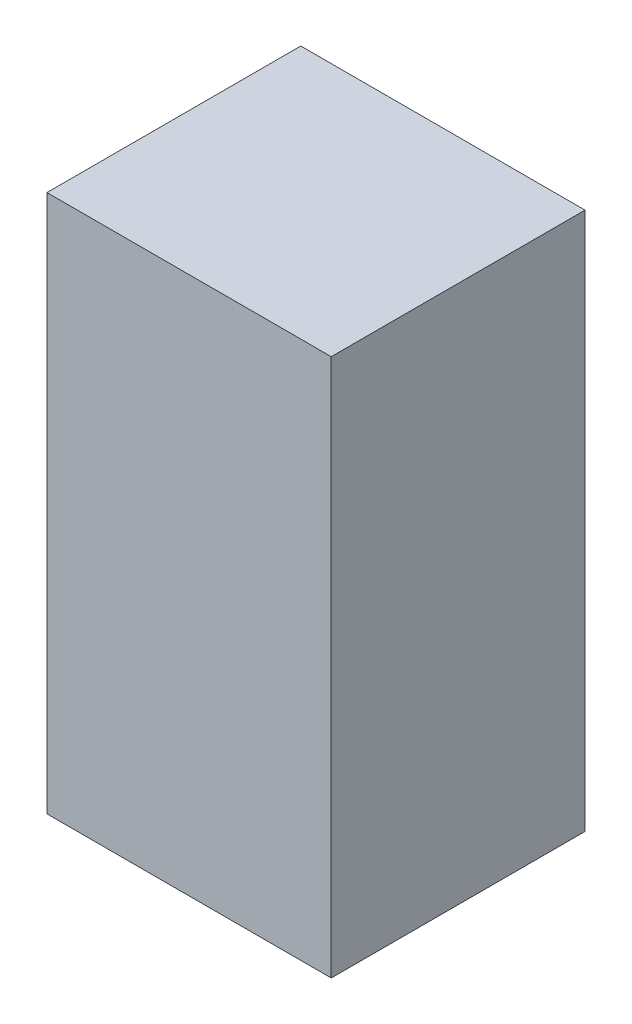
ISO-10303-21;
HEADER;
FILE_DESCRIPTION(('STEP AP214'),'2;1');
FILE_NAME('part.step','',(''),(''),'','','');
FILE_SCHEMA(('AUTOMOTIVE_DESIGN { 1 0 10303 214 1 1 1 1 }'));
ENDSEC;
DATA;
#1=APPLICATION_CONTEXT('core data for automotive mechanical design processes');
#2=APPLICATION_PROTOCOL_DEFINITION('international standard','automotive_design',2000,#1);
#3=PRODUCT_CONTEXT('',#1,'mechanical');
#4=PRODUCT('Part','Part','',(#3));
#5=PRODUCT_RELATED_PRODUCT_CATEGORY('part','',(#4));
#6=PRODUCT_DEFINITION_FORMATION('','',#4);
#7=PRODUCT_DEFINITION_CONTEXT('part definition',#1,'design');
#8=PRODUCT_DEFINITION('design','',#6,#7);
#9=PRODUCT_DEFINITION_SHAPE('','',#8);
#10=(LENGTH_UNIT() NAMED_UNIT(*) SI_UNIT(.MILLI.,.METRE.));
#11=(NAMED_UNIT(*) PLANE_ANGLE_UNIT() SI_UNIT($,.RADIAN.));
#12=(NAMED_UNIT(*) SI_UNIT($,.STERADIAN.) SOLID_ANGLE_UNIT());
#13=UNCERTAINTY_MEASURE_WITH_UNIT(LENGTH_MEASURE(1.E-05),#10,'distance_accuracy_value','');
#14=(GEOMETRIC_REPRESENTATION_CONTEXT(3) GLOBAL_UNCERTAINTY_ASSIGNED_CONTEXT((#13)) GLOBAL_UNIT_ASSIGNED_CONTEXT((#10,
#11,#12)) REPRESENTATION_CONTEXT('',''));
#15=CARTESIAN_POINT('',(0.,0.,0.));
#16=DIRECTION('',(0.,0.,1.));
#17=DIRECTION('',(1.,0.,0.));
#18=AXIS2_PLACEMENT_3D('',#15,#16,#17);
#19=CARTESIAN_POINT('',(0.,0.,6.35));
#20=DIRECTION('',(1.,0.,0.));
#21=DIRECTION('',(0.,0.,-1.));
#22=AXIS2_PLACEMENT_3D('',#19,#20,#21);
#23=PLANE('',#22);
#24=DIRECTION('',(0.,-1.,0.));
#25=VECTOR('',#24,1.);
#26=CARTESIAN_POINT('',(0.,0.,0.));
#27=LINE('',#26,#25);
#28=CARTESIAN_POINT('',(0.,13.462,0.));
#29=VERTEX_POINT('',#28);
#30=CARTESIAN_POINT('',(0.,0.,0.));
#31=VERTEX_POINT('',#30);
#32=EDGE_CURVE('E96',#29,#31,#27,.T.);
#33=ORIENTED_EDGE('',*,*,#32,.T.);
#34=DIRECTION('',(0.,0.,-1.));
#35=VECTOR('',#34,1.);
#36=CARTESIAN_POINT('',(0.,0.,6.35));
#37=LINE('',#36,#35);
#38=CARTESIAN_POINT('',(0.,0.,6.35));
#39=VERTEX_POINT('',#38);
#40=EDGE_CURVE('E11',#39,#31,#37,.T.);
#41=ORIENTED_EDGE('',*,*,#40,.F.);
#42=DIRECTION('',(0.,-1.,0.));
#43=VECTOR('',#42,1.);
#44=CARTESIAN_POINT('',(0.,0.,6.35));
#45=LINE('',#44,#43);
#46=CARTESIAN_POINT('',(0.,13.462,6.35));
#47=VERTEX_POINT('',#46);
#48=EDGE_CURVE('E84',#47,#39,#45,.T.);
#49=ORIENTED_EDGE('',*,*,#48,.F.);
#50=DIRECTION('',(0.,0.,-1.));
#51=VECTOR('',#50,1.);
#52=CARTESIAN_POINT('',(0.,13.462,6.35));
#53=LINE('',#52,#51);
#54=EDGE_CURVE('E92',#47,#29,#53,.T.);
#55=ORIENTED_EDGE('',*,*,#54,.T.);
#56=EDGE_LOOP('',(#33,#41,#49,#55));
#57=FACE_BOUND('',#56,.T.);
#58=ADVANCED_FACE('F33',(#57),#23,.F.);
#59=CARTESIAN_POINT('',(0.,0.,6.35));
#60=DIRECTION('',(0.,1.,0.));
#61=DIRECTION('',(0.,0.,1.));
#62=AXIS2_PLACEMENT_3D('',#59,#60,#61);
#63=PLANE('',#62);
#64=DIRECTION('',(1.,0.,0.));
#65=VECTOR('',#64,1.);
#66=CARTESIAN_POINT('',(0.,0.,0.));
#67=LINE('',#66,#65);
#68=CARTESIAN_POINT('',(7.112,0.,0.));
#69=VERTEX_POINT('',#68);
#70=EDGE_CURVE('E88',#31,#69,#67,.T.);
#71=ORIENTED_EDGE('',*,*,#70,.T.);
#72=DIRECTION('',(0.,0.,-1.));
#73=VECTOR('',#72,1.);
#74=CARTESIAN_POINT('',(7.112,0.,6.35));
#75=LINE('',#74,#73);
#76=CARTESIAN_POINT('',(7.112,0.,6.35));
#77=VERTEX_POINT('',#76);
#78=EDGE_CURVE('E41',#77,#69,#75,.T.);
#79=ORIENTED_EDGE('',*,*,#78,.F.);
#80=DIRECTION('',(1.,0.,0.));
#81=VECTOR('',#80,1.);
#82=CARTESIAN_POINT('',(0.,0.,6.35));
#83=LINE('',#82,#81);
#84=EDGE_CURVE('E79',#39,#77,#83,.T.);
#85=ORIENTED_EDGE('',*,*,#84,.F.);
#86=ORIENTED_EDGE('',*,*,#40,.T.);
#87=EDGE_LOOP('',(#71,#79,#85,#86));
#88=FACE_BOUND('',#87,.T.);
#89=ADVANCED_FACE('F87',(#88),#63,.F.);
#90=CARTESIAN_POINT('',(7.112,0.,6.35));
#91=DIRECTION('',(-1.,0.,0.));
#92=DIRECTION('',(0.,0.,1.));
#93=AXIS2_PLACEMENT_3D('',#90,#91,#92);
#94=PLANE('',#93);
#95=DIRECTION('',(0.,1.,0.));
#96=VECTOR('',#95,1.);
#97=CARTESIAN_POINT('',(7.112,0.,0.));
#98=LINE('',#97,#96);
#99=CARTESIAN_POINT('',(7.112,13.462,0.));
#100=VERTEX_POINT('',#99);
#101=EDGE_CURVE('E66',#69,#100,#98,.T.);
#102=ORIENTED_EDGE('',*,*,#101,.T.);
#103=DIRECTION('',(0.,0.,-1.));
#104=VECTOR('',#103,1.);
#105=CARTESIAN_POINT('',(7.112,13.462,6.35));
#106=LINE('',#105,#104);
#107=CARTESIAN_POINT('',(7.112,13.462,6.35));
#108=VERTEX_POINT('',#107);
#109=EDGE_CURVE('E89',#108,#100,#106,.T.);
#110=ORIENTED_EDGE('',*,*,#109,.F.);
#111=DIRECTION('',(0.,1.,0.));
#112=VECTOR('',#111,1.);
#113=CARTESIAN_POINT('',(7.112,0.,6.35));
#114=LINE('',#113,#112);
#115=EDGE_CURVE('E82',#77,#108,#114,.T.);
#116=ORIENTED_EDGE('',*,*,#115,.F.);
#117=ORIENTED_EDGE('',*,*,#78,.T.);
#118=EDGE_LOOP('',(#102,#110,#116,#117));
#119=FACE_BOUND('',#118,.T.);
#120=ADVANCED_FACE('F90',(#119),#94,.F.);
#121=CARTESIAN_POINT('',(0.,13.462,6.35));
#122=DIRECTION('',(0.,-1.,0.));
#123=DIRECTION('',(0.,0.,-1.));
#124=AXIS2_PLACEMENT_3D('',#121,#122,#123);
#125=PLANE('',#124);
#126=DIRECTION('',(-1.,0.,0.));
#127=VECTOR('',#126,1.);
#128=CARTESIAN_POINT('',(0.,13.462,0.));
#129=LINE('',#128,#127);
#130=EDGE_CURVE('E72',#100,#29,#129,.T.);
#131=ORIENTED_EDGE('',*,*,#130,.T.);
#132=ORIENTED_EDGE('',*,*,#54,.F.);
#133=DIRECTION('',(-1.,0.,0.));
#134=VECTOR('',#133,1.);
#135=CARTESIAN_POINT('',(0.,13.462,6.35));
#136=LINE('',#135,#134);
#137=EDGE_CURVE('E49',#108,#47,#136,.T.);
#138=ORIENTED_EDGE('',*,*,#137,.F.);
#139=ORIENTED_EDGE('',*,*,#109,.T.);
#140=EDGE_LOOP('',(#131,#132,#138,#139));
#141=FACE_BOUND('',#140,.T.);
#142=ADVANCED_FACE('F103',(#141),#125,.F.);
#143=CARTESIAN_POINT('',(0.,0.,6.35));
#144=DIRECTION('',(0.,0.,-1.));
#145=DIRECTION('',(-1.,0.,0.));
#146=AXIS2_PLACEMENT_3D('',#143,#144,#145);
#147=PLANE('',#146);
#148=ORIENTED_EDGE('',*,*,#48,.T.);
#149=ORIENTED_EDGE('',*,*,#84,.T.);
#150=ORIENTED_EDGE('',*,*,#115,.T.);
#151=ORIENTED_EDGE('',*,*,#137,.T.);
#152=EDGE_LOOP('',(#148,#149,#150,#151));
#153=FACE_BOUND('',#152,.T.);
#154=ADVANCED_FACE('F80',(#153),#147,.F.);
#155=CARTESIAN_POINT('',(0.,0.,0.));
#156=DIRECTION('',(0.,0.,-1.));
#157=DIRECTION('',(-1.,0.,0.));
#158=AXIS2_PLACEMENT_3D('',#155,#156,#157);
#159=PLANE('',#158);
#160=ORIENTED_EDGE('',*,*,#32,.F.);
#161=ORIENTED_EDGE('',*,*,#130,.F.);
#162=ORIENTED_EDGE('',*,*,#101,.F.);
#163=ORIENTED_EDGE('',*,*,#70,.F.);
#164=EDGE_LOOP('',(#160,#161,#162,#163));
#165=FACE_BOUND('',#164,.T.);
#166=ADVANCED_FACE('F106',(#165),#159,.T.);
#167=CLOSED_SHELL('',(#58,#89,#120,#142,#154,#166));
#168=MANIFOLD_SOLID_BREP('B2',#167);
#169=ADVANCED_BREP_SHAPE_REPRESENTATION('',(#18,#168),#14);
#170=SHAPE_DEFINITION_REPRESENTATION(#9,#169);
ENDSEC;
END-ISO-10303-21;
